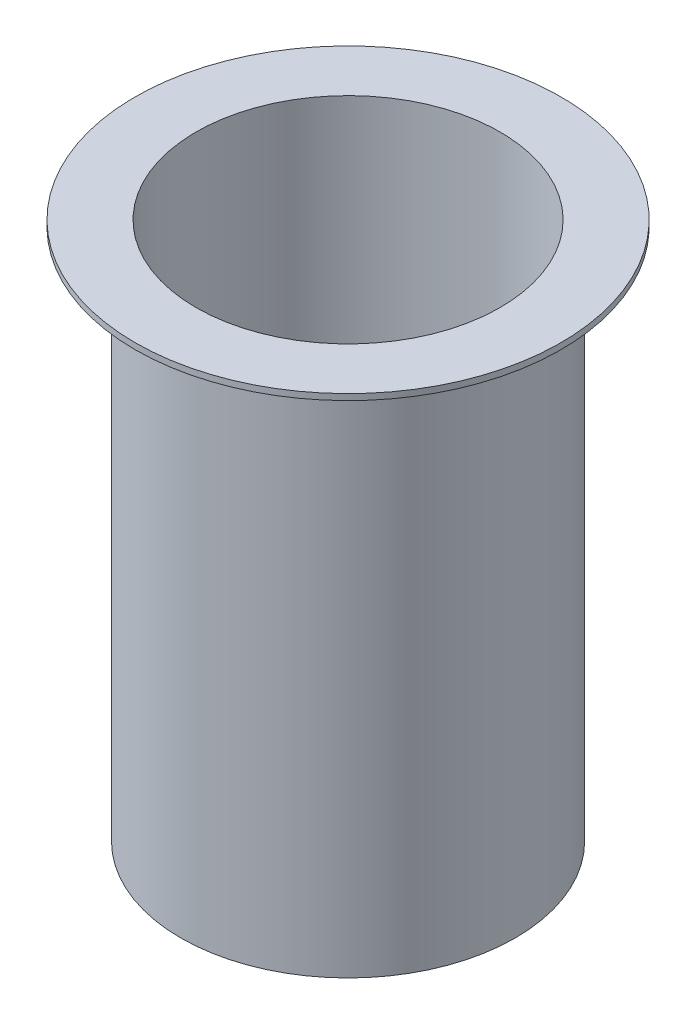
ISO-10303-21;
HEADER;
FILE_DESCRIPTION(('STEP AP214'),'2;1');
FILE_NAME('part.step','',(''),(''),'','','');
FILE_SCHEMA(('AUTOMOTIVE_DESIGN { 1 0 10303 214 1 1 1 1 }'));
ENDSEC;
DATA;
#1=APPLICATION_CONTEXT('core data for automotive mechanical design processes');
#2=APPLICATION_PROTOCOL_DEFINITION('international standard','automotive_design',2000,#1);
#3=PRODUCT_CONTEXT('',#1,'mechanical');
#4=PRODUCT('Part','Part','',(#3));
#5=PRODUCT_RELATED_PRODUCT_CATEGORY('part','',(#4));
#6=PRODUCT_DEFINITION_FORMATION('','',#4);
#7=PRODUCT_DEFINITION_CONTEXT('part definition',#1,'design');
#8=PRODUCT_DEFINITION('design','',#6,#7);
#9=PRODUCT_DEFINITION_SHAPE('','',#8);
#10=(LENGTH_UNIT() NAMED_UNIT(*) SI_UNIT(.MILLI.,.METRE.));
#11=(NAMED_UNIT(*) PLANE_ANGLE_UNIT() SI_UNIT($,.RADIAN.));
#12=(NAMED_UNIT(*) SI_UNIT($,.STERADIAN.) SOLID_ANGLE_UNIT());
#13=UNCERTAINTY_MEASURE_WITH_UNIT(LENGTH_MEASURE(1.E-05),#10,'distance_accuracy_value','');
#14=(GEOMETRIC_REPRESENTATION_CONTEXT(3) GLOBAL_UNCERTAINTY_ASSIGNED_CONTEXT((#13)) GLOBAL_UNIT_ASSIGNED_CONTEXT((#10,
#11,#12)) REPRESENTATION_CONTEXT('',''));
#15=CARTESIAN_POINT('',(0.,0.,0.));
#16=DIRECTION('',(0.,0.,1.));
#17=DIRECTION('',(1.,0.,0.));
#18=AXIS2_PLACEMENT_3D('',#15,#16,#17);
#19=CARTESIAN_POINT('',(0.,-177.,0.));
#20=DIRECTION('',(0.,1.,0.));
#21=DIRECTION('',(0.,0.,1.));
#22=AXIS2_PLACEMENT_3D('',#19,#20,#21);
#23=CYLINDRICAL_SURFACE('',#22,55.);
#24=CARTESIAN_POINT('',(0.,-177.,0.));
#25=DIRECTION('',(0.,1.,0.));
#26=DIRECTION('',(0.,0.,1.));
#27=AXIS2_PLACEMENT_3D('',#24,#25,#26);
#28=CIRCLE('',#27,55.);
#29=CARTESIAN_POINT('',(0.,-177.,55.));
#30=VERTEX_POINT('',#29);
#31=EDGE_CURVE('E10',#30,#30,#28,.T.);
#32=ORIENTED_EDGE('',*,*,#31,.T.);
#33=EDGE_LOOP('',(#32));
#34=FACE_BOUND('',#33,.T.);
#35=CARTESIAN_POINT('',(0.,-2.,0.));
#36=DIRECTION('',(0.,1.,0.));
#37=DIRECTION('',(0.,0.,1.));
#38=AXIS2_PLACEMENT_3D('',#35,#36,#37);
#39=CIRCLE('',#38,55.);
#40=CARTESIAN_POINT('',(0.,-2.,55.));
#41=VERTEX_POINT('',#40);
#42=EDGE_CURVE('E59',#41,#41,#39,.F.);
#43=ORIENTED_EDGE('',*,*,#42,.T.);
#44=EDGE_LOOP('',(#43));
#45=FACE_BOUND('',#44,.T.);
#46=ADVANCED_FACE('F41',(#34,#45),#23,.T.);
#47=CARTESIAN_POINT('',(0.,-177.,0.));
#48=DIRECTION('',(0.,1.,0.));
#49=DIRECTION('',(0.,0.,1.));
#50=AXIS2_PLACEMENT_3D('',#47,#48,#49);
#51=PLANE('',#50);
#52=CARTESIAN_POINT('',(0.,-177.,0.));
#53=DIRECTION('',(0.,1.,0.));
#54=DIRECTION('',(0.,0.,1.));
#55=AXIS2_PLACEMENT_3D('',#52,#53,#54);
#56=CIRCLE('',#55,50.);
#57=CARTESIAN_POINT('',(0.,-177.,50.));
#58=VERTEX_POINT('',#57);
#59=EDGE_CURVE('E48',#58,#58,#56,.T.);
#60=ORIENTED_EDGE('',*,*,#59,.T.);
#61=EDGE_LOOP('',(#60));
#62=FACE_BOUND('',#61,.T.);
#63=ORIENTED_EDGE('',*,*,#31,.F.);
#64=EDGE_LOOP('',(#63));
#65=FACE_BOUND('',#64,.T.);
#66=ADVANCED_FACE('F87',(#62,#65),#51,.F.);
#67=CARTESIAN_POINT('',(0.,0.,0.));
#68=DIRECTION('',(0.,1.,0.));
#69=DIRECTION('',(0.,0.,1.));
#70=AXIS2_PLACEMENT_3D('',#67,#68,#69);
#71=PLANE('',#70);
#72=CARTESIAN_POINT('',(0.,0.,0.));
#73=DIRECTION('',(0.,1.,0.));
#74=DIRECTION('',(0.,0.,1.));
#75=AXIS2_PLACEMENT_3D('',#72,#73,#74);
#76=CIRCLE('',#75,50.);
#77=CARTESIAN_POINT('',(0.,0.,50.));
#78=VERTEX_POINT('',#77);
#79=EDGE_CURVE('E53',#78,#78,#76,.T.);
#80=ORIENTED_EDGE('',*,*,#79,.F.);
#81=EDGE_LOOP('',(#80));
#82=FACE_BOUND('',#81,.T.);
#83=CARTESIAN_POINT('',(0.,0.,0.));
#84=DIRECTION('',(0.,1.,0.));
#85=DIRECTION('',(0.,0.,1.));
#86=AXIS2_PLACEMENT_3D('',#83,#84,#85);
#87=CIRCLE('',#86,70.);
#88=CARTESIAN_POINT('',(0.,0.,70.));
#89=VERTEX_POINT('',#88);
#90=EDGE_CURVE('E65',#89,#89,#87,.T.);
#91=ORIENTED_EDGE('',*,*,#90,.T.);
#92=EDGE_LOOP('',(#91));
#93=FACE_BOUND('',#92,.T.);
#94=ADVANCED_FACE('F91',(#82,#93),#71,.T.);
#95=CARTESIAN_POINT('',(0.,-177.,0.));
#96=DIRECTION('',(0.,1.,0.));
#97=DIRECTION('',(0.,0.,1.));
#98=AXIS2_PLACEMENT_3D('',#95,#96,#97);
#99=CYLINDRICAL_SURFACE('',#98,50.);
#100=ORIENTED_EDGE('',*,*,#79,.T.);
#101=EDGE_LOOP('',(#100));
#102=FACE_BOUND('',#101,.T.);
#103=ORIENTED_EDGE('',*,*,#59,.F.);
#104=EDGE_LOOP('',(#103));
#105=FACE_BOUND('',#104,.T.);
#106=ADVANCED_FACE('F83',(#102,#105),#99,.F.);
#107=CARTESIAN_POINT('',(0.,-2.,0.));
#108=DIRECTION('',(0.,1.,0.));
#109=DIRECTION('',(0.,0.,1.));
#110=AXIS2_PLACEMENT_3D('',#107,#108,#109);
#111=CYLINDRICAL_SURFACE('',#110,70.);
#112=CARTESIAN_POINT('',(0.,-2.,0.));
#113=DIRECTION('',(0.,1.,0.));
#114=DIRECTION('',(0.,0.,1.));
#115=AXIS2_PLACEMENT_3D('',#112,#113,#114);
#116=CIRCLE('',#115,70.);
#117=CARTESIAN_POINT('',(0.,-2.,70.));
#118=VERTEX_POINT('',#117);
#119=EDGE_CURVE('E64',#118,#118,#116,.T.);
#120=ORIENTED_EDGE('',*,*,#119,.T.);
#121=EDGE_LOOP('',(#120));
#122=FACE_BOUND('',#121,.T.);
#123=ORIENTED_EDGE('',*,*,#90,.F.);
#124=EDGE_LOOP('',(#123));
#125=FACE_BOUND('',#124,.T.);
#126=ADVANCED_FACE('F73',(#122,#125),#111,.T.);
#127=CARTESIAN_POINT('',(0.,-2.,0.));
#128=DIRECTION('',(0.,1.,0.));
#129=DIRECTION('',(0.,0.,1.));
#130=AXIS2_PLACEMENT_3D('',#127,#128,#129);
#131=PLANE('',#130);
#132=ORIENTED_EDGE('',*,*,#42,.F.);
#133=EDGE_LOOP('',(#132));
#134=FACE_BOUND('',#133,.T.);
#135=ORIENTED_EDGE('',*,*,#119,.F.);
#136=EDGE_LOOP('',(#135));
#137=FACE_BOUND('',#136,.T.);
#138=ADVANCED_FACE('F76',(#134,#137),#131,.F.);
#139=CLOSED_SHELL('',(#46,#66,#94,#106,#126,#138));
#140=MANIFOLD_SOLID_BREP('B2',#139);
#141=ADVANCED_BREP_SHAPE_REPRESENTATION('',(#18,#140),#14);
#142=SHAPE_DEFINITION_REPRESENTATION(#9,#141);
ENDSEC;
END-ISO-10303-21;
